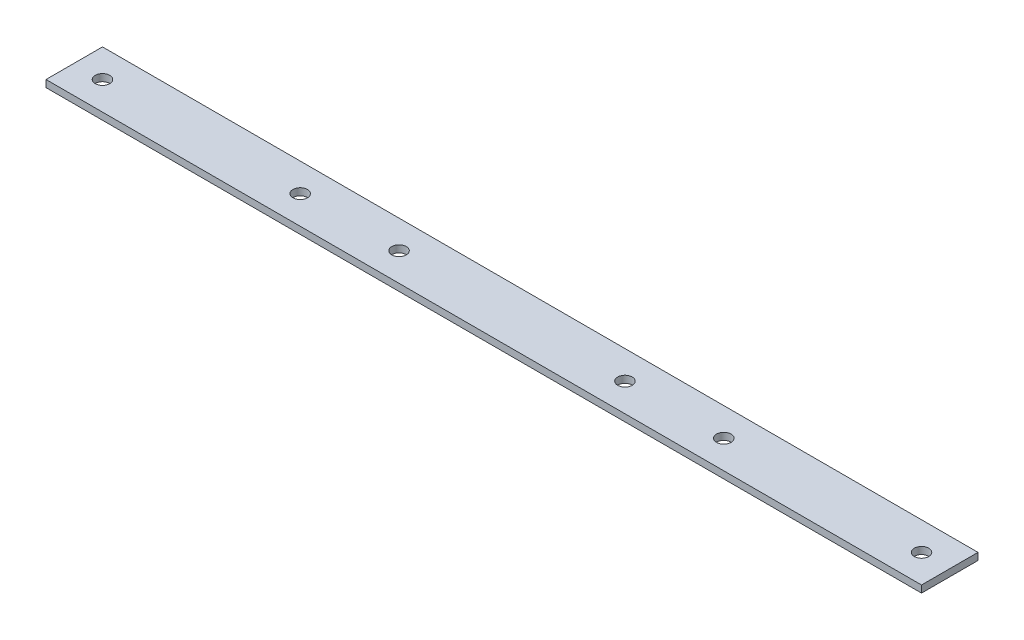
ISO-10303-21;
HEADER;
FILE_DESCRIPTION(('STEP AP214'),'2;1');
FILE_NAME('part.step','',(''),(''),'','','');
FILE_SCHEMA(('AUTOMOTIVE_DESIGN { 1 0 10303 214 1 1 1 1 }'));
ENDSEC;
DATA;
#1=APPLICATION_CONTEXT('core data for automotive mechanical design processes');
#2=APPLICATION_PROTOCOL_DEFINITION('international standard','automotive_design',2000,#1);
#3=PRODUCT_CONTEXT('',#1,'mechanical');
#4=PRODUCT('Part','Part','',(#3));
#5=PRODUCT_RELATED_PRODUCT_CATEGORY('part','',(#4));
#6=PRODUCT_DEFINITION_FORMATION('','',#4);
#7=PRODUCT_DEFINITION_CONTEXT('part definition',#1,'design');
#8=PRODUCT_DEFINITION('design','',#6,#7);
#9=PRODUCT_DEFINITION_SHAPE('','',#8);
#10=(LENGTH_UNIT() NAMED_UNIT(*) SI_UNIT(.MILLI.,.METRE.));
#11=(NAMED_UNIT(*) PLANE_ANGLE_UNIT() SI_UNIT($,.RADIAN.));
#12=(NAMED_UNIT(*) SI_UNIT($,.STERADIAN.) SOLID_ANGLE_UNIT());
#13=UNCERTAINTY_MEASURE_WITH_UNIT(LENGTH_MEASURE(1.E-05),#10,'distance_accuracy_value','');
#14=(GEOMETRIC_REPRESENTATION_CONTEXT(3) GLOBAL_UNCERTAINTY_ASSIGNED_CONTEXT((#13)) GLOBAL_UNIT_ASSIGNED_CONTEXT((#10,
#11,#12)) REPRESENTATION_CONTEXT('',''));
#15=CARTESIAN_POINT('',(0.,0.,0.));
#16=DIRECTION('',(0.,0.,1.));
#17=DIRECTION('',(1.,0.,0.));
#18=AXIS2_PLACEMENT_3D('',#15,#16,#17);
#19=CARTESIAN_POINT('',(196.85,1.5875,12.7));
#20=DIRECTION('',(-1.,0.,0.));
#21=DIRECTION('',(0.,0.,1.));
#22=AXIS2_PLACEMENT_3D('',#19,#20,#21);
#23=PLANE('',#22);
#24=DIRECTION('',(0.,0.,-1.));
#25=VECTOR('',#24,1.);
#26=CARTESIAN_POINT('',(196.85,-1.5875,12.7));
#27=LINE('',#26,#25);
#28=CARTESIAN_POINT('',(196.85,-1.5875,12.7));
#29=VERTEX_POINT('',#28);
#30=CARTESIAN_POINT('',(196.85,-1.5875,-12.7));
#31=VERTEX_POINT('',#30);
#32=EDGE_CURVE('E103',#29,#31,#27,.T.);
#33=ORIENTED_EDGE('',*,*,#32,.T.);
#34=DIRECTION('',(0.,-1.,0.));
#35=VECTOR('',#34,1.);
#36=CARTESIAN_POINT('',(196.85,1.5875,-12.7));
#37=LINE('',#36,#35);
#38=CARTESIAN_POINT('',(196.85,1.5875,-12.7));
#39=VERTEX_POINT('',#38);
#40=EDGE_CURVE('E11',#39,#31,#37,.T.);
#41=ORIENTED_EDGE('',*,*,#40,.F.);
#42=DIRECTION('',(0.,0.,-1.));
#43=VECTOR('',#42,1.);
#44=CARTESIAN_POINT('',(196.85,1.5875,12.7));
#45=LINE('',#44,#43);
#46=CARTESIAN_POINT('',(196.85,1.5875,12.7));
#47=VERTEX_POINT('',#46);
#48=EDGE_CURVE('E91',#47,#39,#45,.T.);
#49=ORIENTED_EDGE('',*,*,#48,.F.);
#50=DIRECTION('',(0.,-1.,0.));
#51=VECTOR('',#50,1.);
#52=CARTESIAN_POINT('',(196.85,1.5875,12.7));
#53=LINE('',#52,#51);
#54=EDGE_CURVE('E99',#47,#29,#53,.T.);
#55=ORIENTED_EDGE('',*,*,#54,.T.);
#56=EDGE_LOOP('',(#33,#41,#49,#55));
#57=FACE_BOUND('',#56,.T.);
#58=ADVANCED_FACE('F40',(#57),#23,.F.);
#59=CARTESIAN_POINT('',(-196.85,1.5875,-12.7));
#60=DIRECTION('',(0.,0.,1.));
#61=DIRECTION('',(1.,0.,0.));
#62=AXIS2_PLACEMENT_3D('',#59,#60,#61);
#63=PLANE('',#62);
#64=DIRECTION('',(-1.,0.,0.));
#65=VECTOR('',#64,1.);
#66=CARTESIAN_POINT('',(-196.85,-1.5875,-12.7));
#67=LINE('',#66,#65);
#68=CARTESIAN_POINT('',(-196.85,-1.5875,-12.7));
#69=VERTEX_POINT('',#68);
#70=EDGE_CURVE('E95',#31,#69,#67,.T.);
#71=ORIENTED_EDGE('',*,*,#70,.T.);
#72=DIRECTION('',(0.,-1.,0.));
#73=VECTOR('',#72,1.);
#74=CARTESIAN_POINT('',(-196.85,1.5875,-12.7));
#75=LINE('',#74,#73);
#76=CARTESIAN_POINT('',(-196.85,1.5875,-12.7));
#77=VERTEX_POINT('',#76);
#78=EDGE_CURVE('E48',#77,#69,#75,.T.);
#79=ORIENTED_EDGE('',*,*,#78,.F.);
#80=DIRECTION('',(-1.,0.,0.));
#81=VECTOR('',#80,1.);
#82=CARTESIAN_POINT('',(-196.85,1.5875,-12.7));
#83=LINE('',#82,#81);
#84=EDGE_CURVE('E86',#39,#77,#83,.T.);
#85=ORIENTED_EDGE('',*,*,#84,.F.);
#86=ORIENTED_EDGE('',*,*,#40,.T.);
#87=EDGE_LOOP('',(#71,#79,#85,#86));
#88=FACE_BOUND('',#87,.T.);
#89=ADVANCED_FACE('F94',(#88),#63,.F.);
#90=CARTESIAN_POINT('',(-196.85,1.5875,12.7));
#91=DIRECTION('',(1.,0.,0.));
#92=DIRECTION('',(0.,0.,-1.));
#93=AXIS2_PLACEMENT_3D('',#90,#91,#92);
#94=PLANE('',#93);
#95=DIRECTION('',(0.,0.,1.));
#96=VECTOR('',#95,1.);
#97=CARTESIAN_POINT('',(-196.85,-1.5875,12.7));
#98=LINE('',#97,#96);
#99=CARTESIAN_POINT('',(-196.85,-1.5875,12.7));
#100=VERTEX_POINT('',#99);
#101=EDGE_CURVE('E73',#69,#100,#98,.T.);
#102=ORIENTED_EDGE('',*,*,#101,.T.);
#103=DIRECTION('',(0.,-1.,0.));
#104=VECTOR('',#103,1.);
#105=CARTESIAN_POINT('',(-196.85,1.5875,12.7));
#106=LINE('',#105,#104);
#107=CARTESIAN_POINT('',(-196.85,1.5875,12.7));
#108=VERTEX_POINT('',#107);
#109=EDGE_CURVE('E96',#108,#100,#106,.T.);
#110=ORIENTED_EDGE('',*,*,#109,.F.);
#111=DIRECTION('',(0.,0.,1.));
#112=VECTOR('',#111,1.);
#113=CARTESIAN_POINT('',(-196.85,1.5875,12.7));
#114=LINE('',#113,#112);
#115=EDGE_CURVE('E89',#77,#108,#114,.T.);
#116=ORIENTED_EDGE('',*,*,#115,.F.);
#117=ORIENTED_EDGE('',*,*,#78,.T.);
#118=EDGE_LOOP('',(#102,#110,#116,#117));
#119=FACE_BOUND('',#118,.T.);
#120=ADVANCED_FACE('F97',(#119),#94,.F.);
#121=CARTESIAN_POINT('',(-196.85,1.5875,12.7));
#122=DIRECTION('',(0.,0.,-1.));
#123=DIRECTION('',(-1.,0.,0.));
#124=AXIS2_PLACEMENT_3D('',#121,#122,#123);
#125=PLANE('',#124);
#126=DIRECTION('',(1.,0.,0.));
#127=VECTOR('',#126,1.);
#128=CARTESIAN_POINT('',(-196.85,-1.5875,12.7));
#129=LINE('',#128,#127);
#130=EDGE_CURVE('E79',#100,#29,#129,.T.);
#131=ORIENTED_EDGE('',*,*,#130,.T.);
#132=ORIENTED_EDGE('',*,*,#54,.F.);
#133=DIRECTION('',(1.,0.,0.));
#134=VECTOR('',#133,1.);
#135=CARTESIAN_POINT('',(-196.85,1.5875,12.7));
#136=LINE('',#135,#134);
#137=EDGE_CURVE('E56',#108,#47,#136,.T.);
#138=ORIENTED_EDGE('',*,*,#137,.F.);
#139=ORIENTED_EDGE('',*,*,#109,.T.);
#140=EDGE_LOOP('',(#131,#132,#138,#139));
#141=FACE_BOUND('',#140,.T.);
#142=ADVANCED_FACE('F111',(#141),#125,.F.);
#143=CARTESIAN_POINT('',(0.,1.5875,0.));
#144=DIRECTION('',(0.,-1.,0.));
#145=DIRECTION('',(0.,0.,-1.));
#146=AXIS2_PLACEMENT_3D('',#143,#144,#145);
#147=PLANE('',#146);
#148=CARTESIAN_POINT('',(-184.15,1.5875,0.));
#149=DIRECTION('',(0.,1.,0.));
#150=DIRECTION('',(0.,0.,1.));
#151=AXIS2_PLACEMENT_3D('',#148,#149,#150);
#152=CIRCLE('',#151,3.26389999999998);
#153=CARTESIAN_POINT('',(-184.15,1.5875,3.26389999999998));
#154=VERTEX_POINT('',#153);
#155=EDGE_CURVE('E130',#154,#154,#152,.T.);
#156=ORIENTED_EDGE('',*,*,#155,.F.);
#157=EDGE_LOOP('',(#156));
#158=FACE_BOUND('',#157,.T.);
#159=CARTESIAN_POINT('',(50.8,1.5875,0.));
#160=DIRECTION('',(0.,1.,0.));
#161=DIRECTION('',(0.,0.,1.));
#162=AXIS2_PLACEMENT_3D('',#159,#160,#161);
#163=CIRCLE('',#162,3.2639);
#164=CARTESIAN_POINT('',(50.8,1.5875,3.2639));
#165=VERTEX_POINT('',#164);
#166=EDGE_CURVE('E135',#165,#165,#163,.T.);
#167=ORIENTED_EDGE('',*,*,#166,.F.);
#168=EDGE_LOOP('',(#167));
#169=FACE_BOUND('',#168,.T.);
#170=CARTESIAN_POINT('',(184.15,1.5875,0.));
#171=DIRECTION('',(0.,1.,0.));
#172=DIRECTION('',(0.,0.,1.));
#173=AXIS2_PLACEMENT_3D('',#170,#171,#172);
#174=CIRCLE('',#173,3.26390000000001);
#175=CARTESIAN_POINT('',(184.15,1.5875,3.26390000000001));
#176=VERTEX_POINT('',#175);
#177=EDGE_CURVE('E127',#176,#176,#174,.T.);
#178=ORIENTED_EDGE('',*,*,#177,.F.);
#179=EDGE_LOOP('',(#178));
#180=FACE_BOUND('',#179,.T.);
#181=CARTESIAN_POINT('',(-95.25,1.5875,0.));
#182=DIRECTION('',(0.,1.,0.));
#183=DIRECTION('',(0.,0.,1.));
#184=AXIS2_PLACEMENT_3D('',#181,#182,#183);
#185=CIRCLE('',#184,3.26389999999999);
#186=CARTESIAN_POINT('',(-95.25,1.5875,3.26389999999999));
#187=VERTEX_POINT('',#186);
#188=EDGE_CURVE('E120',#187,#187,#185,.T.);
#189=ORIENTED_EDGE('',*,*,#188,.F.);
#190=EDGE_LOOP('',(#189));
#191=FACE_BOUND('',#190,.T.);
#192=CARTESIAN_POINT('',(95.25,1.5875,0.));
#193=DIRECTION('',(0.,1.,0.));
#194=DIRECTION('',(0.,0.,1.));
#195=AXIS2_PLACEMENT_3D('',#192,#193,#194);
#196=CIRCLE('',#195,3.26389999999999);
#197=CARTESIAN_POINT('',(95.25,1.5875,3.26389999999999));
#198=VERTEX_POINT('',#197);
#199=EDGE_CURVE('E121',#198,#198,#196,.T.);
#200=ORIENTED_EDGE('',*,*,#199,.F.);
#201=EDGE_LOOP('',(#200));
#202=FACE_BOUND('',#201,.T.);
#203=CARTESIAN_POINT('',(-50.8,1.5875,0.));
#204=DIRECTION('',(0.,1.,0.));
#205=DIRECTION('',(0.,0.,1.));
#206=AXIS2_PLACEMENT_3D('',#203,#204,#205);
#207=CIRCLE('',#206,3.2639);
#208=CARTESIAN_POINT('',(-50.8,1.5875,3.2639));
#209=VERTEX_POINT('',#208);
#210=EDGE_CURVE('E134',#209,#209,#207,.T.);
#211=ORIENTED_EDGE('',*,*,#210,.F.);
#212=EDGE_LOOP('',(#211));
#213=FACE_BOUND('',#212,.T.);
#214=ORIENTED_EDGE('',*,*,#48,.T.);
#215=ORIENTED_EDGE('',*,*,#84,.T.);
#216=ORIENTED_EDGE('',*,*,#115,.T.);
#217=ORIENTED_EDGE('',*,*,#137,.T.);
#218=EDGE_LOOP('',(#214,#215,#216,#217));
#219=FACE_BOUND('',#218,.T.);
#220=ADVANCED_FACE('F87',(#158,#169,#180,#191,#202,#213,#219),#147,.F.);
#221=CARTESIAN_POINT('',(0.,-1.5875,0.));
#222=DIRECTION('',(0.,-1.,0.));
#223=DIRECTION('',(0.,0.,-1.));
#224=AXIS2_PLACEMENT_3D('',#221,#222,#223);
#225=PLANE('',#224);
#226=CARTESIAN_POINT('',(-184.15,-1.5875,0.));
#227=DIRECTION('',(0.,1.,0.));
#228=DIRECTION('',(0.,0.,1.));
#229=AXIS2_PLACEMENT_3D('',#226,#227,#228);
#230=CIRCLE('',#229,3.26389999999998);
#231=CARTESIAN_POINT('',(-184.15,-1.5875,3.26389999999998));
#232=VERTEX_POINT('',#231);
#233=EDGE_CURVE('E106',#232,#232,#230,.T.);
#234=ORIENTED_EDGE('',*,*,#233,.T.);
#235=EDGE_LOOP('',(#234));
#236=FACE_BOUND('',#235,.T.);
#237=CARTESIAN_POINT('',(50.8,-1.5875,0.));
#238=DIRECTION('',(0.,1.,0.));
#239=DIRECTION('',(0.,0.,1.));
#240=AXIS2_PLACEMENT_3D('',#237,#238,#239);
#241=CIRCLE('',#240,3.2639);
#242=CARTESIAN_POINT('',(50.8,-1.5875,3.2639));
#243=VERTEX_POINT('',#242);
#244=EDGE_CURVE('E143',#243,#243,#241,.T.);
#245=ORIENTED_EDGE('',*,*,#244,.T.);
#246=EDGE_LOOP('',(#245));
#247=FACE_BOUND('',#246,.T.);
#248=CARTESIAN_POINT('',(184.15,-1.5875,0.));
#249=DIRECTION('',(0.,1.,0.));
#250=DIRECTION('',(0.,0.,1.));
#251=AXIS2_PLACEMENT_3D('',#248,#249,#250);
#252=CIRCLE('',#251,3.26390000000001);
#253=CARTESIAN_POINT('',(184.15,-1.5875,3.26390000000001));
#254=VERTEX_POINT('',#253);
#255=EDGE_CURVE('E124',#254,#254,#252,.T.);
#256=ORIENTED_EDGE('',*,*,#255,.T.);
#257=EDGE_LOOP('',(#256));
#258=FACE_BOUND('',#257,.T.);
#259=CARTESIAN_POINT('',(-95.25,-1.5875,0.));
#260=DIRECTION('',(0.,1.,0.));
#261=DIRECTION('',(0.,0.,1.));
#262=AXIS2_PLACEMENT_3D('',#259,#260,#261);
#263=CIRCLE('',#262,3.26389999999999);
#264=CARTESIAN_POINT('',(-95.25,-1.5875,3.26389999999999));
#265=VERTEX_POINT('',#264);
#266=EDGE_CURVE('E117',#265,#265,#263,.T.);
#267=ORIENTED_EDGE('',*,*,#266,.T.);
#268=EDGE_LOOP('',(#267));
#269=FACE_BOUND('',#268,.T.);
#270=CARTESIAN_POINT('',(95.25,-1.5875,0.));
#271=DIRECTION('',(0.,1.,0.));
#272=DIRECTION('',(0.,0.,1.));
#273=AXIS2_PLACEMENT_3D('',#270,#271,#272);
#274=CIRCLE('',#273,3.26389999999999);
#275=CARTESIAN_POINT('',(95.25,-1.5875,3.26389999999999));
#276=VERTEX_POINT('',#275);
#277=EDGE_CURVE('E138',#276,#276,#274,.T.);
#278=ORIENTED_EDGE('',*,*,#277,.T.);
#279=EDGE_LOOP('',(#278));
#280=FACE_BOUND('',#279,.T.);
#281=CARTESIAN_POINT('',(-50.8,-1.5875,0.));
#282=DIRECTION('',(0.,1.,0.));
#283=DIRECTION('',(0.,0.,1.));
#284=AXIS2_PLACEMENT_3D('',#281,#282,#283);
#285=CIRCLE('',#284,3.2639);
#286=CARTESIAN_POINT('',(-50.8,-1.5875,3.2639));
#287=VERTEX_POINT('',#286);
#288=EDGE_CURVE('E131',#287,#287,#285,.T.);
#289=ORIENTED_EDGE('',*,*,#288,.T.);
#290=EDGE_LOOP('',(#289));
#291=FACE_BOUND('',#290,.T.);
#292=ORIENTED_EDGE('',*,*,#32,.F.);
#293=ORIENTED_EDGE('',*,*,#130,.F.);
#294=ORIENTED_EDGE('',*,*,#101,.F.);
#295=ORIENTED_EDGE('',*,*,#70,.F.);
#296=EDGE_LOOP('',(#292,#293,#294,#295));
#297=FACE_BOUND('',#296,.T.);
#298=ADVANCED_FACE('F114',(#236,#247,#258,#269,#280,#291,#297),#225,.T.);
#299=CARTESIAN_POINT('',(-50.8,-1.5875,0.));
#300=DIRECTION('',(0.,1.,0.));
#301=DIRECTION('',(0.,0.,1.));
#302=AXIS2_PLACEMENT_3D('',#299,#300,#301);
#303=CYLINDRICAL_SURFACE('',#302,3.2639);
#304=ORIENTED_EDGE('',*,*,#288,.F.);
#305=EDGE_LOOP('',(#304));
#306=FACE_BOUND('',#305,.T.);
#307=ORIENTED_EDGE('',*,*,#210,.T.);
#308=EDGE_LOOP('',(#307));
#309=FACE_BOUND('',#308,.T.);
#310=ADVANCED_FACE('F175',(#306,#309),#303,.F.);
#311=CARTESIAN_POINT('',(95.25,-1.5875,0.));
#312=DIRECTION('',(0.,1.,0.));
#313=DIRECTION('',(0.,0.,1.));
#314=AXIS2_PLACEMENT_3D('',#311,#312,#313);
#315=CYLINDRICAL_SURFACE('',#314,3.26389999999999);
#316=ORIENTED_EDGE('',*,*,#277,.F.);
#317=EDGE_LOOP('',(#316));
#318=FACE_BOUND('',#317,.T.);
#319=ORIENTED_EDGE('',*,*,#199,.T.);
#320=EDGE_LOOP('',(#319));
#321=FACE_BOUND('',#320,.T.);
#322=ADVANCED_FACE('F177',(#318,#321),#315,.F.);
#323=CARTESIAN_POINT('',(-95.25,-1.5875,0.));
#324=DIRECTION('',(0.,1.,0.));
#325=DIRECTION('',(0.,0.,1.));
#326=AXIS2_PLACEMENT_3D('',#323,#324,#325);
#327=CYLINDRICAL_SURFACE('',#326,3.26389999999999);
#328=ORIENTED_EDGE('',*,*,#266,.F.);
#329=EDGE_LOOP('',(#328));
#330=FACE_BOUND('',#329,.T.);
#331=ORIENTED_EDGE('',*,*,#188,.T.);
#332=EDGE_LOOP('',(#331));
#333=FACE_BOUND('',#332,.T.);
#334=ADVANCED_FACE('F184',(#330,#333),#327,.F.);
#335=CARTESIAN_POINT('',(184.15,-1.5875,0.));
#336=DIRECTION('',(0.,1.,0.));
#337=DIRECTION('',(0.,0.,1.));
#338=AXIS2_PLACEMENT_3D('',#335,#336,#337);
#339=CYLINDRICAL_SURFACE('',#338,3.26390000000001);
#340=ORIENTED_EDGE('',*,*,#255,.F.);
#341=EDGE_LOOP('',(#340));
#342=FACE_BOUND('',#341,.T.);
#343=ORIENTED_EDGE('',*,*,#177,.T.);
#344=EDGE_LOOP('',(#343));
#345=FACE_BOUND('',#344,.T.);
#346=ADVANCED_FACE('F202',(#342,#345),#339,.F.);
#347=CARTESIAN_POINT('',(50.8,-1.5875,0.));
#348=DIRECTION('',(0.,1.,0.));
#349=DIRECTION('',(0.,0.,1.));
#350=AXIS2_PLACEMENT_3D('',#347,#348,#349);
#351=CYLINDRICAL_SURFACE('',#350,3.2639);
#352=ORIENTED_EDGE('',*,*,#244,.F.);
#353=EDGE_LOOP('',(#352));
#354=FACE_BOUND('',#353,.T.);
#355=ORIENTED_EDGE('',*,*,#166,.T.);
#356=EDGE_LOOP('',(#355));
#357=FACE_BOUND('',#356,.T.);
#358=ADVANCED_FACE('F158',(#354,#357),#351,.F.);
#359=CARTESIAN_POINT('',(-184.15,-1.5875,0.));
#360=DIRECTION('',(0.,1.,0.));
#361=DIRECTION('',(0.,0.,1.));
#362=AXIS2_PLACEMENT_3D('',#359,#360,#361);
#363=CYLINDRICAL_SURFACE('',#362,3.26389999999998);
#364=ORIENTED_EDGE('',*,*,#233,.F.);
#365=EDGE_LOOP('',(#364));
#366=FACE_BOUND('',#365,.T.);
#367=ORIENTED_EDGE('',*,*,#155,.T.);
#368=EDGE_LOOP('',(#367));
#369=FACE_BOUND('',#368,.T.);
#370=ADVANCED_FACE('F155',(#366,#369),#363,.F.);
#371=CLOSED_SHELL('',(#58,#89,#120,#142,#220,#298,#310,#322,#334,#346,#358,#370));
#372=MANIFOLD_SOLID_BREP('B2',#371);
#373=ADVANCED_BREP_SHAPE_REPRESENTATION('',(#18,#372),#14);
#374=SHAPE_DEFINITION_REPRESENTATION(#9,#373);
ENDSEC;
END-ISO-10303-21;
